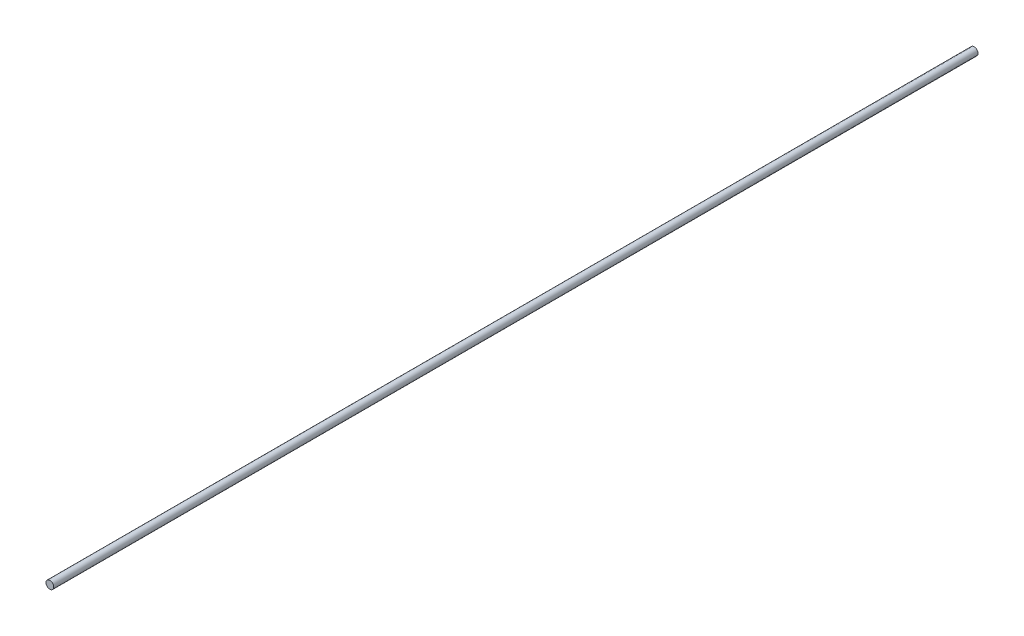
ISO-10303-21;
HEADER;
FILE_DESCRIPTION(('STEP AP214'),'2;1');
FILE_NAME('part.step','',(''),(''),'','','');
FILE_SCHEMA(('AUTOMOTIVE_DESIGN { 1 0 10303 214 1 1 1 1 }'));
ENDSEC;
DATA;
#1=APPLICATION_CONTEXT('core data for automotive mechanical design processes');
#2=APPLICATION_PROTOCOL_DEFINITION('international standard','automotive_design',2000,#1);
#3=PRODUCT_CONTEXT('',#1,'mechanical');
#4=PRODUCT('Part','Part','',(#3));
#5=PRODUCT_RELATED_PRODUCT_CATEGORY('part','',(#4));
#6=PRODUCT_DEFINITION_FORMATION('','',#4);
#7=PRODUCT_DEFINITION_CONTEXT('part definition',#1,'design');
#8=PRODUCT_DEFINITION('design','',#6,#7);
#9=PRODUCT_DEFINITION_SHAPE('','',#8);
#10=(LENGTH_UNIT() NAMED_UNIT(*) SI_UNIT(.MILLI.,.METRE.));
#11=(NAMED_UNIT(*) PLANE_ANGLE_UNIT() SI_UNIT($,.RADIAN.));
#12=(NAMED_UNIT(*) SI_UNIT($,.STERADIAN.) SOLID_ANGLE_UNIT());
#13=UNCERTAINTY_MEASURE_WITH_UNIT(LENGTH_MEASURE(1.E-05),#10,'distance_accuracy_value','');
#14=(GEOMETRIC_REPRESENTATION_CONTEXT(3) GLOBAL_UNCERTAINTY_ASSIGNED_CONTEXT((#13)) GLOBAL_UNIT_ASSIGNED_CONTEXT((#10,
#11,#12)) REPRESENTATION_CONTEXT('',''));
#15=CARTESIAN_POINT('',(0.,0.,0.));
#16=DIRECTION('',(0.,0.,1.));
#17=DIRECTION('',(1.,0.,0.));
#18=AXIS2_PLACEMENT_3D('',#15,#16,#17);
#19=CARTESIAN_POINT('',(0.,0.,762.));
#20=DIRECTION('',(0.,0.,-1.));
#21=DIRECTION('',(-1.,0.,0.));
#22=AXIS2_PLACEMENT_3D('',#19,#20,#21);
#23=CYLINDRICAL_SURFACE('',#22,3.175);
#24=CARTESIAN_POINT('',(0.,0.,762.));
#25=DIRECTION('',(0.,0.,1.));
#26=DIRECTION('',(1.,0.,0.));
#27=AXIS2_PLACEMENT_3D('',#24,#25,#26);
#28=CIRCLE('',#27,3.175);
#29=CARTESIAN_POINT('',(3.175,0.,762.));
#30=VERTEX_POINT('',#29);
#31=EDGE_CURVE('E10',#30,#30,#28,.T.);
#32=ORIENTED_EDGE('',*,*,#31,.F.);
#33=EDGE_LOOP('',(#32));
#34=FACE_BOUND('',#33,.T.);
#35=CARTESIAN_POINT('',(0.,0.,0.));
#36=DIRECTION('',(0.,0.,1.));
#37=DIRECTION('',(1.,0.,0.));
#38=AXIS2_PLACEMENT_3D('',#35,#36,#37);
#39=CIRCLE('',#38,3.175);
#40=CARTESIAN_POINT('',(3.175,0.,0.));
#41=VERTEX_POINT('',#40);
#42=EDGE_CURVE('E38',#41,#41,#39,.T.);
#43=ORIENTED_EDGE('',*,*,#42,.T.);
#44=EDGE_LOOP('',(#43));
#45=FACE_BOUND('',#44,.T.);
#46=ADVANCED_FACE('F35',(#34,#45),#23,.T.);
#47=CARTESIAN_POINT('',(0.,0.,762.));
#48=DIRECTION('',(0.,0.,1.));
#49=DIRECTION('',(1.,0.,0.));
#50=AXIS2_PLACEMENT_3D('',#47,#48,#49);
#51=PLANE('',#50);
#52=ORIENTED_EDGE('',*,*,#31,.T.);
#53=EDGE_LOOP('',(#52));
#54=FACE_BOUND('',#53,.T.);
#55=ADVANCED_FACE('F50',(#54),#51,.T.);
#56=CARTESIAN_POINT('',(0.,0.,0.));
#57=DIRECTION('',(0.,0.,1.));
#58=DIRECTION('',(1.,0.,0.));
#59=AXIS2_PLACEMENT_3D('',#56,#57,#58);
#60=PLANE('',#59);
#61=ORIENTED_EDGE('',*,*,#42,.F.);
#62=EDGE_LOOP('',(#61));
#63=FACE_BOUND('',#62,.T.);
#64=ADVANCED_FACE('F48',(#63),#60,.F.);
#65=CLOSED_SHELL('',(#46,#55,#64));
#66=MANIFOLD_SOLID_BREP('B2',#65);
#67=ADVANCED_BREP_SHAPE_REPRESENTATION('',(#18,#66),#14);
#68=SHAPE_DEFINITION_REPRESENTATION(#9,#67);
ENDSEC;
END-ISO-10303-21;
